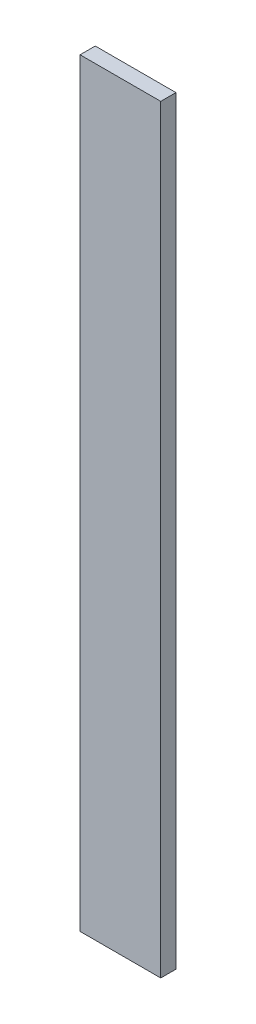
ISO-10303-21;
HEADER;
FILE_DESCRIPTION(('STEP AP214'),'2;1');
FILE_NAME('part.step','',(''),(''),'','','');
FILE_SCHEMA(('AUTOMOTIVE_DESIGN { 1 0 10303 214 1 1 1 1 }'));
ENDSEC;
DATA;
#1=APPLICATION_CONTEXT('core data for automotive mechanical design processes');
#2=APPLICATION_PROTOCOL_DEFINITION('international standard','automotive_design',2000,#1);
#3=PRODUCT_CONTEXT('',#1,'mechanical');
#4=PRODUCT('Part','Part','',(#3));
#5=PRODUCT_RELATED_PRODUCT_CATEGORY('part','',(#4));
#6=PRODUCT_DEFINITION_FORMATION('','',#4);
#7=PRODUCT_DEFINITION_CONTEXT('part definition',#1,'design');
#8=PRODUCT_DEFINITION('design','',#6,#7);
#9=PRODUCT_DEFINITION_SHAPE('','',#8);
#10=(LENGTH_UNIT() NAMED_UNIT(*) SI_UNIT(.MILLI.,.METRE.));
#11=(NAMED_UNIT(*) PLANE_ANGLE_UNIT() SI_UNIT($,.RADIAN.));
#12=(NAMED_UNIT(*) SI_UNIT($,.STERADIAN.) SOLID_ANGLE_UNIT());
#13=UNCERTAINTY_MEASURE_WITH_UNIT(LENGTH_MEASURE(1.E-05),#10,'distance_accuracy_value','');
#14=(GEOMETRIC_REPRESENTATION_CONTEXT(3) GLOBAL_UNCERTAINTY_ASSIGNED_CONTEXT((#13)) GLOBAL_UNIT_ASSIGNED_CONTEXT((#10,
#11,#12)) REPRESENTATION_CONTEXT('',''));
#15=CARTESIAN_POINT('',(0.,0.,0.));
#16=DIRECTION('',(0.,0.,1.));
#17=DIRECTION('',(1.,0.,0.));
#18=AXIS2_PLACEMENT_3D('',#15,#16,#17);
#19=CARTESIAN_POINT('',(150.923289575803,142.200586634191,5.9));
#20=DIRECTION('',(0.,0.,1.));
#21=DIRECTION('',(1.,0.,0.));
#22=AXIS2_PLACEMENT_3D('',#19,#20,#21);
#23=PLANE('',#22);
#24=DIRECTION('',(1.,0.,0.));
#25=VECTOR('',#24,1.);
#26=CARTESIAN_POINT('',(150.923289575803,147.200586634191,5.9));
#27=LINE('',#26,#25);
#28=CARTESIAN_POINT('',(151.454539575803,147.200586634191,5.9));
#29=VERTEX_POINT('',#28);
#30=CARTESIAN_POINT('',(150.923289575803,147.200586634191,5.9));
#31=VERTEX_POINT('',#30);
#32=EDGE_CURVE('E20',#29,#31,#27,.F.);
#33=ORIENTED_EDGE('',*,*,#32,.F.);
#34=DIRECTION('',(0.,1.,0.));
#35=VECTOR('',#34,1.);
#36=CARTESIAN_POINT('',(151.454539575803,142.200586634191,5.9));
#37=LINE('',#36,#35);
#38=CARTESIAN_POINT('',(151.454539575803,142.200586634191,5.9));
#39=VERTEX_POINT('',#38);
#40=EDGE_CURVE('E69',#29,#39,#37,.F.);
#41=ORIENTED_EDGE('',*,*,#40,.T.);
#42=DIRECTION('',(1.,0.,0.));
#43=VECTOR('',#42,1.);
#44=CARTESIAN_POINT('',(150.923289575803,142.200586634191,5.9));
#45=LINE('',#44,#43);
#46=CARTESIAN_POINT('',(150.923289575803,142.200586634191,5.9));
#47=VERTEX_POINT('',#46);
#48=EDGE_CURVE('E56',#39,#47,#45,.F.);
#49=ORIENTED_EDGE('',*,*,#48,.T.);
#50=DIRECTION('',(0.,1.,0.));
#51=VECTOR('',#50,1.);
#52=CARTESIAN_POINT('',(150.923289575803,147.200586634191,5.9));
#53=LINE('',#52,#51);
#54=EDGE_CURVE('E62',#47,#31,#53,.T.);
#55=ORIENTED_EDGE('',*,*,#54,.T.);
#56=EDGE_LOOP('',(#33,#41,#49,#55));
#57=FACE_BOUND('',#56,.T.);
#58=ADVANCED_FACE('F17',(#57),#23,.F.);
#59=CARTESIAN_POINT('',(150.923289575803,147.200586634191,6.));
#60=DIRECTION('',(1.,0.,0.));
#61=DIRECTION('',(0.,0.,-1.));
#62=AXIS2_PLACEMENT_3D('',#59,#60,#61);
#63=PLANE('',#62);
#64=DIRECTION('',(0.,0.,1.));
#65=VECTOR('',#64,1.);
#66=CARTESIAN_POINT('',(150.923289575803,142.200586634191,6.));
#67=LINE('',#66,#65);
#68=CARTESIAN_POINT('',(150.923289575803,142.200586634191,6.));
#69=VERTEX_POINT('',#68);
#70=EDGE_CURVE('E64',#47,#69,#67,.T.);
#71=ORIENTED_EDGE('',*,*,#70,.T.);
#72=DIRECTION('',(0.,1.,0.));
#73=VECTOR('',#72,1.);
#74=CARTESIAN_POINT('',(150.923289575803,142.200586634191,6.));
#75=LINE('',#74,#73);
#76=CARTESIAN_POINT('',(150.923289575803,147.200586634191,6.));
#77=VERTEX_POINT('',#76);
#78=EDGE_CURVE('E83',#77,#69,#75,.F.);
#79=ORIENTED_EDGE('',*,*,#78,.F.);
#80=DIRECTION('',(0.,0.,-1.));
#81=VECTOR('',#80,1.);
#82=CARTESIAN_POINT('',(150.923289575803,147.200586634191,6.));
#83=LINE('',#82,#81);
#84=EDGE_CURVE('E67',#77,#31,#83,.T.);
#85=ORIENTED_EDGE('',*,*,#84,.T.);
#86=ORIENTED_EDGE('',*,*,#54,.F.);
#87=EDGE_LOOP('',(#71,#79,#85,#86));
#88=FACE_BOUND('',#87,.T.);
#89=ADVANCED_FACE('F63',(#88),#63,.F.);
#90=CARTESIAN_POINT('',(150.923289575803,142.200586634191,6.));
#91=DIRECTION('',(0.,1.,0.));
#92=DIRECTION('',(0.,0.,1.));
#93=AXIS2_PLACEMENT_3D('',#90,#91,#92);
#94=PLANE('',#93);
#95=DIRECTION('',(0.,0.,1.));
#96=VECTOR('',#95,1.);
#97=CARTESIAN_POINT('',(151.454539575803,142.200586634191,6.));
#98=LINE('',#97,#96);
#99=CARTESIAN_POINT('',(151.454539575803,142.200586634191,6.));
#100=VERTEX_POINT('',#99);
#101=EDGE_CURVE('E71',#39,#100,#98,.T.);
#102=ORIENTED_EDGE('',*,*,#101,.T.);
#103=DIRECTION('',(1.,0.,0.));
#104=VECTOR('',#103,1.);
#105=CARTESIAN_POINT('',(150.923289575803,142.200586634191,6.));
#106=LINE('',#105,#104);
#107=EDGE_CURVE('E75',#69,#100,#106,.T.);
#108=ORIENTED_EDGE('',*,*,#107,.F.);
#109=ORIENTED_EDGE('',*,*,#70,.F.);
#110=ORIENTED_EDGE('',*,*,#48,.F.);
#111=EDGE_LOOP('',(#102,#108,#109,#110));
#112=FACE_BOUND('',#111,.T.);
#113=ADVANCED_FACE('F73',(#112),#94,.F.);
#114=CARTESIAN_POINT('',(151.454539575803,142.200586634191,6.));
#115=DIRECTION('',(-1.,0.,0.));
#116=DIRECTION('',(0.,0.,1.));
#117=AXIS2_PLACEMENT_3D('',#114,#115,#116);
#118=PLANE('',#117);
#119=DIRECTION('',(0.,0.,-1.));
#120=VECTOR('',#119,1.);
#121=CARTESIAN_POINT('',(151.454539575803,147.200586634191,6.));
#122=LINE('',#121,#120);
#123=CARTESIAN_POINT('',(151.454539575803,147.200586634191,6.));
#124=VERTEX_POINT('',#123);
#125=EDGE_CURVE('E35',#29,#124,#122,.F.);
#126=ORIENTED_EDGE('',*,*,#125,.T.);
#127=DIRECTION('',(0.,1.,0.));
#128=VECTOR('',#127,1.);
#129=CARTESIAN_POINT('',(151.454539575803,142.200586634191,6.));
#130=LINE('',#129,#128);
#131=EDGE_CURVE('E26',#100,#124,#130,.T.);
#132=ORIENTED_EDGE('',*,*,#131,.F.);
#133=ORIENTED_EDGE('',*,*,#101,.F.);
#134=ORIENTED_EDGE('',*,*,#40,.F.);
#135=EDGE_LOOP('',(#126,#132,#133,#134));
#136=FACE_BOUND('',#135,.T.);
#137=ADVANCED_FACE('F89',(#136),#118,.F.);
#138=CARTESIAN_POINT('',(151.454539575803,147.200586634191,6.));
#139=DIRECTION('',(0.,-1.,0.));
#140=DIRECTION('',(0.,0.,-1.));
#141=AXIS2_PLACEMENT_3D('',#138,#139,#140);
#142=PLANE('',#141);
#143=ORIENTED_EDGE('',*,*,#84,.F.);
#144=DIRECTION('',(1.,0.,0.));
#145=VECTOR('',#144,1.);
#146=CARTESIAN_POINT('',(150.923289575803,147.200586634191,6.));
#147=LINE('',#146,#145);
#148=EDGE_CURVE('E11',#124,#77,#147,.F.);
#149=ORIENTED_EDGE('',*,*,#148,.F.);
#150=ORIENTED_EDGE('',*,*,#125,.F.);
#151=ORIENTED_EDGE('',*,*,#32,.T.);
#152=EDGE_LOOP('',(#143,#149,#150,#151));
#153=FACE_BOUND('',#152,.T.);
#154=ADVANCED_FACE('F91',(#153),#142,.F.);
#155=CARTESIAN_POINT('',(150.923289575803,142.200586634191,6.));
#156=DIRECTION('',(0.,0.,1.));
#157=DIRECTION('',(1.,0.,0.));
#158=AXIS2_PLACEMENT_3D('',#155,#156,#157);
#159=PLANE('',#158);
#160=ORIENTED_EDGE('',*,*,#131,.T.);
#161=ORIENTED_EDGE('',*,*,#148,.T.);
#162=ORIENTED_EDGE('',*,*,#78,.T.);
#163=ORIENTED_EDGE('',*,*,#107,.T.);
#164=EDGE_LOOP('',(#160,#161,#162,#163));
#165=FACE_BOUND('',#164,.T.);
#166=ADVANCED_FACE('F88',(#165),#159,.T.);
#167=CLOSED_SHELL('',(#58,#89,#113,#137,#154,#166));
#168=MANIFOLD_SOLID_BREP('B1',#167);
#169=ADVANCED_BREP_SHAPE_REPRESENTATION('',(#18,#168),#14);
#170=SHAPE_DEFINITION_REPRESENTATION(#9,#169);
ENDSEC;
END-ISO-10303-21;
